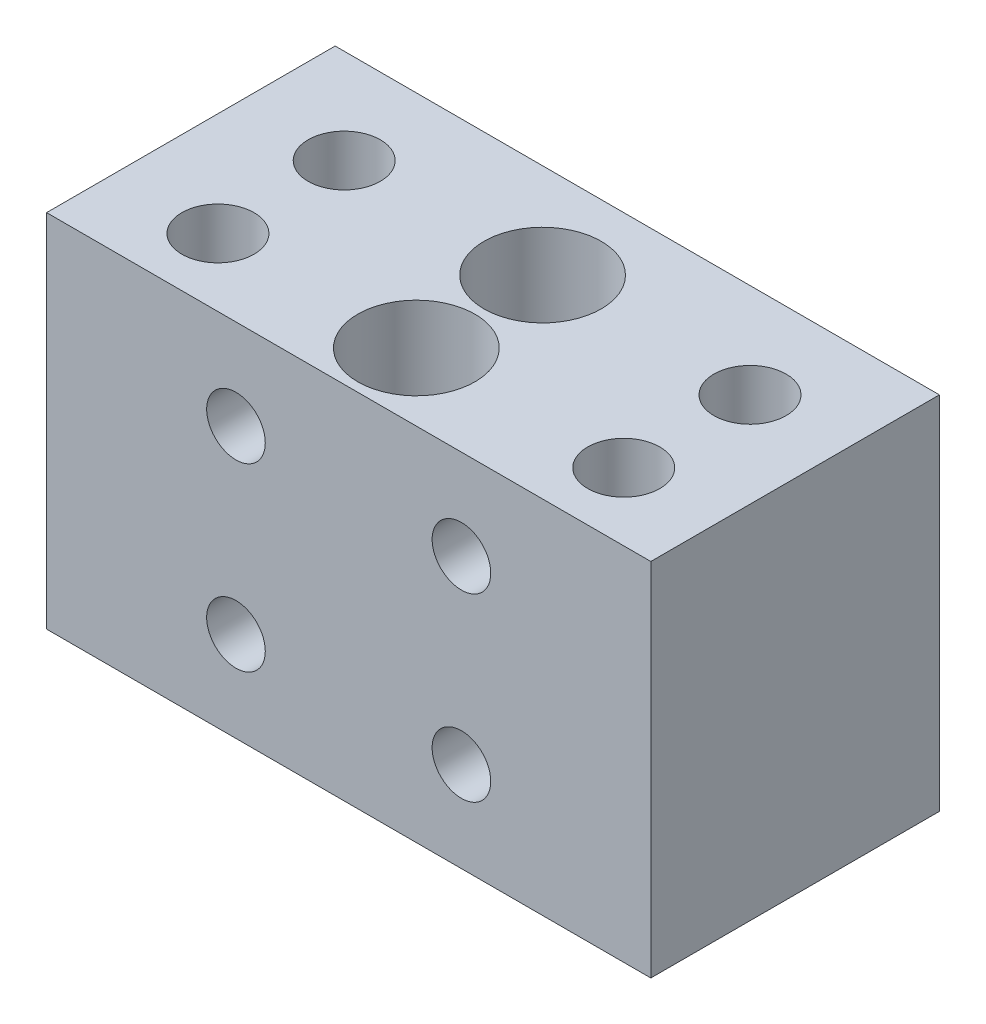
ISO-10303-21;
HEADER;
FILE_DESCRIPTION(('STEP AP214'),'2;1');
FILE_NAME('part.step','',(''),(''),'','','');
FILE_SCHEMA(('AUTOMOTIVE_DESIGN { 1 0 10303 214 1 1 1 1 }'));
ENDSEC;
DATA;
#1=APPLICATION_CONTEXT('core data for automotive mechanical design processes');
#2=APPLICATION_PROTOCOL_DEFINITION('international standard','automotive_design',2000,#1);
#3=PRODUCT_CONTEXT('',#1,'mechanical');
#4=PRODUCT('Part','Part','',(#3));
#5=PRODUCT_RELATED_PRODUCT_CATEGORY('part','',(#4));
#6=PRODUCT_DEFINITION_FORMATION('','',#4);
#7=PRODUCT_DEFINITION_CONTEXT('part definition',#1,'design');
#8=PRODUCT_DEFINITION('design','',#6,#7);
#9=PRODUCT_DEFINITION_SHAPE('','',#8);
#10=(LENGTH_UNIT() NAMED_UNIT(*) SI_UNIT(.MILLI.,.METRE.));
#11=(NAMED_UNIT(*) PLANE_ANGLE_UNIT() SI_UNIT($,.RADIAN.));
#12=(NAMED_UNIT(*) SI_UNIT($,.STERADIAN.) SOLID_ANGLE_UNIT());
#13=UNCERTAINTY_MEASURE_WITH_UNIT(LENGTH_MEASURE(1.E-05),#10,'distance_accuracy_value','');
#14=(GEOMETRIC_REPRESENTATION_CONTEXT(3) GLOBAL_UNCERTAINTY_ASSIGNED_CONTEXT((#13)) GLOBAL_UNIT_ASSIGNED_CONTEXT((#10,
#11,#12)) REPRESENTATION_CONTEXT('',''));
#15=CARTESIAN_POINT('',(0.,0.,0.));
#16=DIRECTION('',(0.,0.,1.));
#17=DIRECTION('',(1.,0.,0.));
#18=AXIS2_PLACEMENT_3D('',#15,#16,#17);
#19=CARTESIAN_POINT('',(56.5,40.,10.5));
#20=DIRECTION('',(0.,-1.,0.));
#21=DIRECTION('',(0.,0.,-1.));
#22=AXIS2_PLACEMENT_3D('',#19,#20,#21);
#23=CYLINDRICAL_SURFACE('',#22,4.);
#24=CARTESIAN_POINT('',(56.5,40.,10.5));
#25=DIRECTION('',(0.,-1.,0.));
#26=DIRECTION('',(0.,0.,-1.));
#27=AXIS2_PLACEMENT_3D('',#24,#25,#26);
#28=CIRCLE('',#27,4.);
#29=CARTESIAN_POINT('',(56.5,40.,6.5));
#30=VERTEX_POINT('',#29);
#31=EDGE_CURVE('E244',#30,#30,#28,.T.);
#32=ORIENTED_EDGE('',*,*,#31,.F.);
#33=EDGE_LOOP('',(#32));
#34=FACE_BOUND('',#33,.T.);
#35=CARTESIAN_POINT('',(56.5,19.,10.5));
#36=DIRECTION('',(0.,-1.,0.));
#37=DIRECTION('',(0.,0.,-1.));
#38=AXIS2_PLACEMENT_3D('',#35,#36,#37);
#39=CIRCLE('',#38,4.);
#40=CARTESIAN_POINT('',(56.5,19.,6.5));
#41=VERTEX_POINT('',#40);
#42=EDGE_CURVE('E11',#41,#41,#39,.T.);
#43=ORIENTED_EDGE('',*,*,#42,.T.);
#44=EDGE_LOOP('',(#43));
#45=FACE_BOUND('',#44,.T.);
#46=ADVANCED_FACE('F39',(#34,#45),#23,.F.);
#47=CARTESIAN_POINT('',(56.5,19.,10.5));
#48=DIRECTION('',(0.,-1.,0.));
#49=DIRECTION('',(0.,0.,-1.));
#50=AXIS2_PLACEMENT_3D('',#47,#48,#49);
#51=PLANE('',#50);
#52=ORIENTED_EDGE('',*,*,#42,.F.);
#53=EDGE_LOOP('',(#52));
#54=FACE_BOUND('',#53,.T.);
#55=CARTESIAN_POINT('',(56.5,19.,10.5));
#56=DIRECTION('',(0.,-1.,0.));
#57=DIRECTION('',(0.,0.,-1.));
#58=AXIS2_PLACEMENT_3D('',#55,#56,#57);
#59=CIRCLE('',#58,6.);
#60=CARTESIAN_POINT('',(56.5,19.,4.5));
#61=VERTEX_POINT('',#60);
#62=EDGE_CURVE('E47',#61,#61,#59,.T.);
#63=ORIENTED_EDGE('',*,*,#62,.T.);
#64=EDGE_LOOP('',(#63));
#65=FACE_BOUND('',#64,.T.);
#66=ADVANCED_FACE('F252',(#54,#65),#51,.T.);
#67=CARTESIAN_POINT('',(56.5,19.,10.5));
#68=DIRECTION('',(0.,-1.,0.));
#69=DIRECTION('',(0.,0.,-1.));
#70=AXIS2_PLACEMENT_3D('',#67,#68,#69);
#71=CYLINDRICAL_SURFACE('',#70,6.);
#72=ORIENTED_EDGE('',*,*,#62,.F.);
#73=EDGE_LOOP('',(#72));
#74=FACE_BOUND('',#73,.T.);
#75=CARTESIAN_POINT('',(56.5,0.,10.5));
#76=DIRECTION('',(0.,-1.,0.));
#77=DIRECTION('',(0.,0.,-1.));
#78=AXIS2_PLACEMENT_3D('',#75,#76,#77);
#79=CIRCLE('',#78,6.);
#80=CARTESIAN_POINT('',(56.5,0.,4.5));
#81=VERTEX_POINT('',#80);
#82=EDGE_CURVE('E247',#81,#81,#79,.T.);
#83=ORIENTED_EDGE('',*,*,#82,.T.);
#84=EDGE_LOOP('',(#83));
#85=FACE_BOUND('',#84,.T.);
#86=ADVANCED_FACE('F254',(#74,#85),#71,.F.);
#87=CARTESIAN_POINT('',(11.5,40.,10.5));
#88=DIRECTION('',(0.,-1.,0.));
#89=DIRECTION('',(0.,0.,-1.));
#90=AXIS2_PLACEMENT_3D('',#87,#88,#89);
#91=CYLINDRICAL_SURFACE('',#90,4.);
#92=CARTESIAN_POINT('',(11.5,40.,10.5));
#93=DIRECTION('',(0.,-1.,0.));
#94=DIRECTION('',(0.,0.,-1.));
#95=AXIS2_PLACEMENT_3D('',#92,#93,#94);
#96=CIRCLE('',#95,4.);
#97=CARTESIAN_POINT('',(11.5,40.,6.5));
#98=VERTEX_POINT('',#97);
#99=EDGE_CURVE('E232',#98,#98,#96,.T.);
#100=ORIENTED_EDGE('',*,*,#99,.F.);
#101=EDGE_LOOP('',(#100));
#102=FACE_BOUND('',#101,.T.);
#103=CARTESIAN_POINT('',(11.5,19.,10.5));
#104=DIRECTION('',(0.,-1.,0.));
#105=DIRECTION('',(0.,0.,-1.));
#106=AXIS2_PLACEMENT_3D('',#103,#104,#105);
#107=CIRCLE('',#106,4.);
#108=CARTESIAN_POINT('',(11.5,19.,6.5));
#109=VERTEX_POINT('',#108);
#110=EDGE_CURVE('E241',#109,#109,#107,.T.);
#111=ORIENTED_EDGE('',*,*,#110,.T.);
#112=EDGE_LOOP('',(#111));
#113=FACE_BOUND('',#112,.T.);
#114=ADVANCED_FACE('F257',(#102,#113),#91,.F.);
#115=CARTESIAN_POINT('',(11.5,19.,10.5));
#116=DIRECTION('',(0.,-1.,0.));
#117=DIRECTION('',(0.,0.,-1.));
#118=AXIS2_PLACEMENT_3D('',#115,#116,#117);
#119=PLANE('',#118);
#120=ORIENTED_EDGE('',*,*,#110,.F.);
#121=EDGE_LOOP('',(#120));
#122=FACE_BOUND('',#121,.T.);
#123=CARTESIAN_POINT('',(11.5,19.,10.5));
#124=DIRECTION('',(0.,-1.,0.));
#125=DIRECTION('',(0.,0.,-1.));
#126=AXIS2_PLACEMENT_3D('',#123,#124,#125);
#127=CIRCLE('',#126,6.);
#128=CARTESIAN_POINT('',(11.5,19.,4.5));
#129=VERTEX_POINT('',#128);
#130=EDGE_CURVE('E238',#129,#129,#127,.T.);
#131=ORIENTED_EDGE('',*,*,#130,.T.);
#132=EDGE_LOOP('',(#131));
#133=FACE_BOUND('',#132,.T.);
#134=ADVANCED_FACE('F572',(#122,#133),#119,.T.);
#135=CARTESIAN_POINT('',(11.5,19.,10.5));
#136=DIRECTION('',(0.,-1.,0.));
#137=DIRECTION('',(0.,0.,-1.));
#138=AXIS2_PLACEMENT_3D('',#135,#136,#137);
#139=CYLINDRICAL_SURFACE('',#138,6.);
#140=ORIENTED_EDGE('',*,*,#130,.F.);
#141=EDGE_LOOP('',(#140));
#142=FACE_BOUND('',#141,.T.);
#143=CARTESIAN_POINT('',(11.5,0.,10.5));
#144=DIRECTION('',(0.,-1.,0.));
#145=DIRECTION('',(0.,0.,-1.));
#146=AXIS2_PLACEMENT_3D('',#143,#144,#145);
#147=CIRCLE('',#146,6.);
#148=CARTESIAN_POINT('',(11.5,0.,4.5));
#149=VERTEX_POINT('',#148);
#150=EDGE_CURVE('E235',#149,#149,#147,.T.);
#151=ORIENTED_EDGE('',*,*,#150,.T.);
#152=EDGE_LOOP('',(#151));
#153=FACE_BOUND('',#152,.T.);
#154=ADVANCED_FACE('F273',(#142,#153),#139,.F.);
#155=CARTESIAN_POINT('',(0.,0.,32.));
#156=DIRECTION('',(1.,0.,0.));
#157=DIRECTION('',(0.,0.,-1.));
#158=AXIS2_PLACEMENT_3D('',#155,#156,#157);
#159=PLANE('',#158);
#160=DIRECTION('',(0.,-1.,0.));
#161=VECTOR('',#160,1.);
#162=CARTESIAN_POINT('',(0.,0.,0.));
#163=LINE('',#162,#161);
#164=CARTESIAN_POINT('',(0.,40.,0.));
#165=VERTEX_POINT('',#164);
#166=CARTESIAN_POINT('',(0.,0.,0.));
#167=VERTEX_POINT('',#166);
#168=EDGE_CURVE('E209',#165,#167,#163,.T.);
#169=ORIENTED_EDGE('',*,*,#168,.T.);
#170=DIRECTION('',(0.,0.,-1.));
#171=VECTOR('',#170,1.);
#172=CARTESIAN_POINT('',(0.,0.,32.));
#173=LINE('',#172,#171);
#174=CARTESIAN_POINT('',(0.,0.,32.));
#175=VERTEX_POINT('',#174);
#176=EDGE_CURVE('E230',#175,#167,#173,.T.);
#177=ORIENTED_EDGE('',*,*,#176,.F.);
#178=DIRECTION('',(0.,-1.,0.));
#179=VECTOR('',#178,1.);
#180=CARTESIAN_POINT('',(0.,0.,32.));
#181=LINE('',#180,#179);
#182=CARTESIAN_POINT('',(0.,40.,32.));
#183=VERTEX_POINT('',#182);
#184=EDGE_CURVE('E212',#183,#175,#181,.T.);
#185=ORIENTED_EDGE('',*,*,#184,.F.);
#186=DIRECTION('',(0.,0.,-1.));
#187=VECTOR('',#186,1.);
#188=CARTESIAN_POINT('',(0.,40.,32.));
#189=LINE('',#188,#187);
#190=EDGE_CURVE('E218',#183,#165,#189,.T.);
#191=ORIENTED_EDGE('',*,*,#190,.T.);
#192=EDGE_LOOP('',(#169,#177,#185,#191));
#193=FACE_BOUND('',#192,.T.);
#194=ADVANCED_FACE('F264',(#193),#159,.F.);
#195=CARTESIAN_POINT('',(0.,0.,32.));
#196=DIRECTION('',(0.,1.,0.));
#197=DIRECTION('',(0.,0.,1.));
#198=AXIS2_PLACEMENT_3D('',#195,#196,#197);
#199=PLANE('',#198);
#200=CARTESIAN_POINT('',(45.5,0.,17.5));
#201=DIRECTION('',(0.,-1.,0.));
#202=DIRECTION('',(0.,0.,-1.));
#203=AXIS2_PLACEMENT_3D('',#200,#201,#202);
#204=CIRCLE('',#203,1.24999999999999);
#205=CARTESIAN_POINT('',(45.5,0.,16.25));
#206=VERTEX_POINT('',#205);
#207=EDGE_CURVE('E105',#206,#206,#204,.T.);
#208=ORIENTED_EDGE('',*,*,#207,.F.);
#209=EDGE_LOOP('',(#208));
#210=FACE_BOUND('',#209,.T.);
#211=CARTESIAN_POINT('',(21.5,0.,17.5));
#212=DIRECTION('',(0.,-1.,0.));
#213=DIRECTION('',(0.,0.,-1.));
#214=AXIS2_PLACEMENT_3D('',#211,#212,#213);
#215=CIRCLE('',#214,1.24999999999999);
#216=CARTESIAN_POINT('',(21.5,0.,16.25));
#217=VERTEX_POINT('',#216);
#218=EDGE_CURVE('E104',#217,#217,#215,.T.);
#219=ORIENTED_EDGE('',*,*,#218,.F.);
#220=EDGE_LOOP('',(#219));
#221=FACE_BOUND('',#220,.T.);
#222=CARTESIAN_POINT('',(33.5,0.,24.5));
#223=DIRECTION('',(0.,1.,0.));
#224=DIRECTION('',(0.,0.,1.));
#225=AXIS2_PLACEMENT_3D('',#222,#223,#224);
#226=CIRCLE('',#225,1.65);
#227=CARTESIAN_POINT('',(33.5,0.,26.15));
#228=VERTEX_POINT('',#227);
#229=EDGE_CURVE('E166',#228,#228,#226,.T.);
#230=ORIENTED_EDGE('',*,*,#229,.T.);
#231=EDGE_LOOP('',(#230));
#232=FACE_BOUND('',#231,.T.);
#233=CARTESIAN_POINT('',(33.5,0.,10.5));
#234=DIRECTION('',(0.,1.,0.));
#235=DIRECTION('',(0.,0.,1.));
#236=AXIS2_PLACEMENT_3D('',#233,#234,#235);
#237=CIRCLE('',#236,1.65);
#238=CARTESIAN_POINT('',(33.5,0.,12.15));
#239=VERTEX_POINT('',#238);
#240=EDGE_CURVE('E172',#239,#239,#237,.T.);
#241=ORIENTED_EDGE('',*,*,#240,.T.);
#242=EDGE_LOOP('',(#241));
#243=FACE_BOUND('',#242,.T.);
#244=CARTESIAN_POINT('',(56.5,0.,24.5));
#245=DIRECTION('',(0.,-1.,0.));
#246=DIRECTION('',(0.,0.,-1.));
#247=AXIS2_PLACEMENT_3D('',#244,#245,#246);
#248=CIRCLE('',#247,6.);
#249=CARTESIAN_POINT('',(56.5,0.,18.5));
#250=VERTEX_POINT('',#249);
#251=EDGE_CURVE('E190',#250,#250,#248,.T.);
#252=ORIENTED_EDGE('',*,*,#251,.F.);
#253=EDGE_LOOP('',(#252));
#254=FACE_BOUND('',#253,.T.);
#255=CARTESIAN_POINT('',(11.5,0.,24.5));
#256=DIRECTION('',(0.,-1.,0.));
#257=DIRECTION('',(0.,0.,-1.));
#258=AXIS2_PLACEMENT_3D('',#255,#256,#257);
#259=CIRCLE('',#258,6.);
#260=CARTESIAN_POINT('',(11.5,0.,18.5));
#261=VERTEX_POINT('',#260);
#262=EDGE_CURVE('E203',#261,#261,#259,.T.);
#263=ORIENTED_EDGE('',*,*,#262,.F.);
#264=EDGE_LOOP('',(#263));
#265=FACE_BOUND('',#264,.T.);
#266=DIRECTION('',(1.,0.,0.));
#267=VECTOR('',#266,1.);
#268=CARTESIAN_POINT('',(0.,0.,0.));
#269=LINE('',#268,#267);
#270=CARTESIAN_POINT('',(67.,0.,0.));
#271=VERTEX_POINT('',#270);
#272=EDGE_CURVE('E221',#167,#271,#269,.T.);
#273=ORIENTED_EDGE('',*,*,#272,.T.);
#274=DIRECTION('',(0.,0.,-1.));
#275=VECTOR('',#274,1.);
#276=CARTESIAN_POINT('',(67.,0.,32.));
#277=LINE('',#276,#275);
#278=CARTESIAN_POINT('',(67.,0.,32.));
#279=VERTEX_POINT('',#278);
#280=EDGE_CURVE('E228',#279,#271,#277,.T.);
#281=ORIENTED_EDGE('',*,*,#280,.F.);
#282=DIRECTION('',(1.,0.,0.));
#283=VECTOR('',#282,1.);
#284=CARTESIAN_POINT('',(0.,0.,32.));
#285=LINE('',#284,#283);
#286=EDGE_CURVE('E87',#175,#279,#285,.T.);
#287=ORIENTED_EDGE('',*,*,#286,.F.);
#288=ORIENTED_EDGE('',*,*,#176,.T.);
#289=EDGE_LOOP('',(#273,#281,#287,#288));
#290=FACE_BOUND('',#289,.T.);
#291=ORIENTED_EDGE('',*,*,#150,.F.);
#292=EDGE_LOOP('',(#291));
#293=FACE_BOUND('',#292,.T.);
#294=ORIENTED_EDGE('',*,*,#82,.F.);
#295=EDGE_LOOP('',(#294));
#296=FACE_BOUND('',#295,.T.);
#297=ADVANCED_FACE('F261',(#210,#221,#232,#243,#254,#265,#290,#293,#296),#199,.F.);
#298=CARTESIAN_POINT('',(67.,0.,32.));
#299=DIRECTION('',(-1.,0.,0.));
#300=DIRECTION('',(0.,0.,1.));
#301=AXIS2_PLACEMENT_3D('',#298,#299,#300);
#302=PLANE('',#301);
#303=DIRECTION('',(0.,1.,0.));
#304=VECTOR('',#303,1.);
#305=CARTESIAN_POINT('',(67.,0.,0.));
#306=LINE('',#305,#304);
#307=CARTESIAN_POINT('',(67.,40.,0.));
#308=VERTEX_POINT('',#307);
#309=EDGE_CURVE('E73',#271,#308,#306,.T.);
#310=ORIENTED_EDGE('',*,*,#309,.T.);
#311=DIRECTION('',(0.,0.,-1.));
#312=VECTOR('',#311,1.);
#313=CARTESIAN_POINT('',(67.,40.,32.));
#314=LINE('',#313,#312);
#315=CARTESIAN_POINT('',(67.,40.,32.));
#316=VERTEX_POINT('',#315);
#317=EDGE_CURVE('E226',#316,#308,#314,.T.);
#318=ORIENTED_EDGE('',*,*,#317,.F.);
#319=DIRECTION('',(0.,1.,0.));
#320=VECTOR('',#319,1.);
#321=CARTESIAN_POINT('',(67.,0.,32.));
#322=LINE('',#321,#320);
#323=EDGE_CURVE('E215',#279,#316,#322,.T.);
#324=ORIENTED_EDGE('',*,*,#323,.F.);
#325=ORIENTED_EDGE('',*,*,#280,.T.);
#326=EDGE_LOOP('',(#310,#318,#324,#325));
#327=FACE_BOUND('',#326,.T.);
#328=ADVANCED_FACE('F263',(#327),#302,.F.);
#329=CARTESIAN_POINT('',(0.,40.,32.));
#330=DIRECTION('',(0.,-1.,0.));
#331=DIRECTION('',(0.,0.,-1.));
#332=AXIS2_PLACEMENT_3D('',#329,#330,#331);
#333=PLANE('',#332);
#334=CARTESIAN_POINT('',(33.5,40.,10.5));
#335=DIRECTION('',(0.,1.,0.));
#336=DIRECTION('',(0.,0.,1.));
#337=AXIS2_PLACEMENT_3D('',#334,#335,#336);
#338=CIRCLE('',#337,6.50000000000003);
#339=CARTESIAN_POINT('',(33.5,40.,17.));
#340=VERTEX_POINT('',#339);
#341=EDGE_CURVE('E180',#340,#340,#338,.T.);
#342=ORIENTED_EDGE('',*,*,#341,.F.);
#343=EDGE_LOOP('',(#342));
#344=FACE_BOUND('',#343,.T.);
#345=CARTESIAN_POINT('',(33.5,40.,24.5));
#346=DIRECTION('',(0.,1.,0.));
#347=DIRECTION('',(0.,0.,1.));
#348=AXIS2_PLACEMENT_3D('',#345,#346,#347);
#349=CIRCLE('',#348,6.50000000000003);
#350=CARTESIAN_POINT('',(33.5,40.,31.));
#351=VERTEX_POINT('',#350);
#352=EDGE_CURVE('E175',#351,#351,#349,.T.);
#353=ORIENTED_EDGE('',*,*,#352,.F.);
#354=EDGE_LOOP('',(#353));
#355=FACE_BOUND('',#354,.T.);
#356=CARTESIAN_POINT('',(56.5,40.,24.5));
#357=DIRECTION('',(0.,-1.,0.));
#358=DIRECTION('',(0.,0.,-1.));
#359=AXIS2_PLACEMENT_3D('',#356,#357,#358);
#360=CIRCLE('',#359,4.);
#361=CARTESIAN_POINT('',(56.5,40.,20.5));
#362=VERTEX_POINT('',#361);
#363=EDGE_CURVE('E179',#362,#362,#360,.T.);
#364=ORIENTED_EDGE('',*,*,#363,.T.);
#365=EDGE_LOOP('',(#364));
#366=FACE_BOUND('',#365,.T.);
#367=CARTESIAN_POINT('',(11.5,40.,24.5));
#368=DIRECTION('',(0.,-1.,0.));
#369=DIRECTION('',(0.,0.,-1.));
#370=AXIS2_PLACEMENT_3D('',#367,#368,#369);
#371=CIRCLE('',#370,4.);
#372=CARTESIAN_POINT('',(11.5,40.,20.5));
#373=VERTEX_POINT('',#372);
#374=EDGE_CURVE('E200',#373,#373,#371,.T.);
#375=ORIENTED_EDGE('',*,*,#374,.T.);
#376=EDGE_LOOP('',(#375));
#377=FACE_BOUND('',#376,.T.);
#378=DIRECTION('',(-1.,0.,0.));
#379=VECTOR('',#378,1.);
#380=CARTESIAN_POINT('',(0.,40.,0.));
#381=LINE('',#380,#379);
#382=EDGE_CURVE('E79',#308,#165,#381,.T.);
#383=ORIENTED_EDGE('',*,*,#382,.T.);
#384=ORIENTED_EDGE('',*,*,#190,.F.);
#385=DIRECTION('',(-1.,0.,0.));
#386=VECTOR('',#385,1.);
#387=CARTESIAN_POINT('',(0.,40.,32.));
#388=LINE('',#387,#386);
#389=EDGE_CURVE('E55',#316,#183,#388,.T.);
#390=ORIENTED_EDGE('',*,*,#389,.F.);
#391=ORIENTED_EDGE('',*,*,#317,.T.);
#392=EDGE_LOOP('',(#383,#384,#390,#391));
#393=FACE_BOUND('',#392,.T.);
#394=ORIENTED_EDGE('',*,*,#99,.T.);
#395=EDGE_LOOP('',(#394));
#396=FACE_BOUND('',#395,.T.);
#397=ORIENTED_EDGE('',*,*,#31,.T.);
#398=EDGE_LOOP('',(#397));
#399=FACE_BOUND('',#398,.T.);
#400=ADVANCED_FACE('F271',(#344,#355,#366,#377,#393,#396,#399),#333,.F.);
#401=CARTESIAN_POINT('',(0.,0.,32.));
#402=DIRECTION('',(0.,0.,-1.));
#403=DIRECTION('',(-1.,0.,0.));
#404=AXIS2_PLACEMENT_3D('',#401,#402,#403);
#405=PLANE('',#404);
#406=CARTESIAN_POINT('',(46.,10.,32.));
#407=DIRECTION('',(0.,0.,1.));
#408=DIRECTION('',(1.,0.,0.));
#409=AXIS2_PLACEMENT_3D('',#406,#407,#408);
#410=CIRCLE('',#409,3.25);
#411=CARTESIAN_POINT('',(49.25,10.,32.));
#412=VERTEX_POINT('',#411);
#413=EDGE_CURVE('E115',#412,#412,#410,.T.);
#414=ORIENTED_EDGE('',*,*,#413,.F.);
#415=EDGE_LOOP('',(#414));
#416=FACE_BOUND('',#415,.T.);
#417=CARTESIAN_POINT('',(46.,30.,32.));
#418=DIRECTION('',(0.,0.,1.));
#419=DIRECTION('',(1.,0.,0.));
#420=AXIS2_PLACEMENT_3D('',#417,#418,#419);
#421=CIRCLE('',#420,3.25);
#422=CARTESIAN_POINT('',(49.25,30.,32.));
#423=VERTEX_POINT('',#422);
#424=EDGE_CURVE('E127',#423,#423,#421,.T.);
#425=ORIENTED_EDGE('',*,*,#424,.F.);
#426=EDGE_LOOP('',(#425));
#427=FACE_BOUND('',#426,.T.);
#428=CARTESIAN_POINT('',(21.,10.,32.));
#429=DIRECTION('',(0.,0.,1.));
#430=DIRECTION('',(1.,0.,0.));
#431=AXIS2_PLACEMENT_3D('',#428,#429,#430);
#432=CIRCLE('',#431,3.25);
#433=CARTESIAN_POINT('',(24.25,10.,32.));
#434=VERTEX_POINT('',#433);
#435=EDGE_CURVE('E139',#434,#434,#432,.T.);
#436=ORIENTED_EDGE('',*,*,#435,.F.);
#437=EDGE_LOOP('',(#436));
#438=FACE_BOUND('',#437,.T.);
#439=CARTESIAN_POINT('',(21.,30.,32.));
#440=DIRECTION('',(0.,0.,1.));
#441=DIRECTION('',(1.,0.,0.));
#442=AXIS2_PLACEMENT_3D('',#439,#440,#441);
#443=CIRCLE('',#442,3.25);
#444=CARTESIAN_POINT('',(24.25,30.,32.));
#445=VERTEX_POINT('',#444);
#446=EDGE_CURVE('E151',#445,#445,#443,.T.);
#447=ORIENTED_EDGE('',*,*,#446,.F.);
#448=EDGE_LOOP('',(#447));
#449=FACE_BOUND('',#448,.T.);
#450=ORIENTED_EDGE('',*,*,#184,.T.);
#451=ORIENTED_EDGE('',*,*,#286,.T.);
#452=ORIENTED_EDGE('',*,*,#323,.T.);
#453=ORIENTED_EDGE('',*,*,#389,.T.);
#454=EDGE_LOOP('',(#450,#451,#452,#453));
#455=FACE_BOUND('',#454,.T.);
#456=ADVANCED_FACE('F289',(#416,#427,#438,#449,#455),#405,.F.);
#457=CARTESIAN_POINT('',(0.,0.,0.));
#458=DIRECTION('',(0.,0.,-1.));
#459=DIRECTION('',(-1.,0.,0.));
#460=AXIS2_PLACEMENT_3D('',#457,#458,#459);
#461=PLANE('',#460);
#462=CARTESIAN_POINT('',(46.,10.,0.));
#463=DIRECTION('',(0.,0.,1.));
#464=DIRECTION('',(1.,0.,0.));
#465=AXIS2_PLACEMENT_3D('',#462,#463,#464);
#466=CIRCLE('',#465,1.69999999999999);
#467=CARTESIAN_POINT('',(47.7,10.,0.));
#468=VERTEX_POINT('',#467);
#469=EDGE_CURVE('E124',#468,#468,#466,.T.);
#470=ORIENTED_EDGE('',*,*,#469,.T.);
#471=EDGE_LOOP('',(#470));
#472=FACE_BOUND('',#471,.T.);
#473=CARTESIAN_POINT('',(46.,30.,0.));
#474=DIRECTION('',(0.,0.,1.));
#475=DIRECTION('',(1.,0.,0.));
#476=AXIS2_PLACEMENT_3D('',#473,#474,#475);
#477=CIRCLE('',#476,1.69999999999999);
#478=CARTESIAN_POINT('',(47.7,30.,0.));
#479=VERTEX_POINT('',#478);
#480=EDGE_CURVE('E136',#479,#479,#477,.T.);
#481=ORIENTED_EDGE('',*,*,#480,.T.);
#482=EDGE_LOOP('',(#481));
#483=FACE_BOUND('',#482,.T.);
#484=CARTESIAN_POINT('',(21.,10.,0.));
#485=DIRECTION('',(0.,0.,1.));
#486=DIRECTION('',(1.,0.,0.));
#487=AXIS2_PLACEMENT_3D('',#484,#485,#486);
#488=CIRCLE('',#487,1.69999999999999);
#489=CARTESIAN_POINT('',(22.7,10.,0.));
#490=VERTEX_POINT('',#489);
#491=EDGE_CURVE('E148',#490,#490,#488,.T.);
#492=ORIENTED_EDGE('',*,*,#491,.T.);
#493=EDGE_LOOP('',(#492));
#494=FACE_BOUND('',#493,.T.);
#495=CARTESIAN_POINT('',(21.,30.,0.));
#496=DIRECTION('',(0.,0.,1.));
#497=DIRECTION('',(1.,0.,0.));
#498=AXIS2_PLACEMENT_3D('',#495,#496,#497);
#499=CIRCLE('',#498,1.69999999999999);
#500=CARTESIAN_POINT('',(22.7,30.,0.));
#501=VERTEX_POINT('',#500);
#502=EDGE_CURVE('E160',#501,#501,#499,.T.);
#503=ORIENTED_EDGE('',*,*,#502,.T.);
#504=EDGE_LOOP('',(#503));
#505=FACE_BOUND('',#504,.T.);
#506=ORIENTED_EDGE('',*,*,#168,.F.);
#507=ORIENTED_EDGE('',*,*,#382,.F.);
#508=ORIENTED_EDGE('',*,*,#309,.F.);
#509=ORIENTED_EDGE('',*,*,#272,.F.);
#510=EDGE_LOOP('',(#506,#507,#508,#509));
#511=FACE_BOUND('',#510,.T.);
#512=ADVANCED_FACE('F295',(#472,#483,#494,#505,#511),#461,.T.);
#513=CARTESIAN_POINT('',(11.5,19.,24.5));
#514=DIRECTION('',(0.,-1.,0.));
#515=DIRECTION('',(0.,0.,-1.));
#516=AXIS2_PLACEMENT_3D('',#513,#514,#515);
#517=CYLINDRICAL_SURFACE('',#516,6.);
#518=CARTESIAN_POINT('',(11.5,19.,24.5));
#519=DIRECTION('',(0.,-1.,0.));
#520=DIRECTION('',(0.,0.,-1.));
#521=AXIS2_PLACEMENT_3D('',#518,#519,#520);
#522=CIRCLE('',#521,6.);
#523=CARTESIAN_POINT('',(11.5,19.,18.5));
#524=VERTEX_POINT('',#523);
#525=EDGE_CURVE('E206',#524,#524,#522,.T.);
#526=ORIENTED_EDGE('',*,*,#525,.F.);
#527=EDGE_LOOP('',(#526));
#528=FACE_BOUND('',#527,.T.);
#529=ORIENTED_EDGE('',*,*,#262,.T.);
#530=EDGE_LOOP('',(#529));
#531=FACE_BOUND('',#530,.T.);
#532=ADVANCED_FACE('F302',(#528,#531),#517,.F.);
#533=CARTESIAN_POINT('',(11.5,19.,24.5));
#534=DIRECTION('',(0.,-1.,0.));
#535=DIRECTION('',(0.,0.,-1.));
#536=AXIS2_PLACEMENT_3D('',#533,#534,#535);
#537=PLANE('',#536);
#538=CARTESIAN_POINT('',(11.5,19.,24.5));
#539=DIRECTION('',(0.,-1.,0.));
#540=DIRECTION('',(0.,0.,-1.));
#541=AXIS2_PLACEMENT_3D('',#538,#539,#540);
#542=CIRCLE('',#541,4.);
#543=CARTESIAN_POINT('',(11.5,19.,20.5));
#544=VERTEX_POINT('',#543);
#545=EDGE_CURVE('E199',#544,#544,#542,.T.);
#546=ORIENTED_EDGE('',*,*,#545,.F.);
#547=EDGE_LOOP('',(#546));
#548=FACE_BOUND('',#547,.T.);
#549=ORIENTED_EDGE('',*,*,#525,.T.);
#550=EDGE_LOOP('',(#549));
#551=FACE_BOUND('',#550,.T.);
#552=ADVANCED_FACE('F307',(#548,#551),#537,.T.);
#553=CARTESIAN_POINT('',(11.5,40.,24.5));
#554=DIRECTION('',(0.,-1.,0.));
#555=DIRECTION('',(0.,0.,-1.));
#556=AXIS2_PLACEMENT_3D('',#553,#554,#555);
#557=CYLINDRICAL_SURFACE('',#556,4.);
#558=ORIENTED_EDGE('',*,*,#374,.F.);
#559=EDGE_LOOP('',(#558));
#560=FACE_BOUND('',#559,.T.);
#561=ORIENTED_EDGE('',*,*,#545,.T.);
#562=EDGE_LOOP('',(#561));
#563=FACE_BOUND('',#562,.T.);
#564=ADVANCED_FACE('F311',(#560,#563),#557,.F.);
#565=CARTESIAN_POINT('',(56.5,19.,24.5));
#566=DIRECTION('',(0.,-1.,0.));
#567=DIRECTION('',(0.,0.,-1.));
#568=AXIS2_PLACEMENT_3D('',#565,#566,#567);
#569=CYLINDRICAL_SURFACE('',#568,6.);
#570=CARTESIAN_POINT('',(56.5,19.,24.5));
#571=DIRECTION('',(0.,-1.,0.));
#572=DIRECTION('',(0.,0.,-1.));
#573=AXIS2_PLACEMENT_3D('',#570,#571,#572);
#574=CIRCLE('',#573,6.);
#575=CARTESIAN_POINT('',(56.5,19.,18.5));
#576=VERTEX_POINT('',#575);
#577=EDGE_CURVE('E196',#576,#576,#574,.T.);
#578=ORIENTED_EDGE('',*,*,#577,.F.);
#579=EDGE_LOOP('',(#578));
#580=FACE_BOUND('',#579,.T.);
#581=ORIENTED_EDGE('',*,*,#251,.T.);
#582=EDGE_LOOP('',(#581));
#583=FACE_BOUND('',#582,.T.);
#584=ADVANCED_FACE('F315',(#580,#583),#569,.F.);
#585=CARTESIAN_POINT('',(56.5,19.,24.5));
#586=DIRECTION('',(0.,-1.,0.));
#587=DIRECTION('',(0.,0.,-1.));
#588=AXIS2_PLACEMENT_3D('',#585,#586,#587);
#589=PLANE('',#588);
#590=CARTESIAN_POINT('',(56.5,19.,24.5));
#591=DIRECTION('',(0.,-1.,0.));
#592=DIRECTION('',(0.,0.,-1.));
#593=AXIS2_PLACEMENT_3D('',#590,#591,#592);
#594=CIRCLE('',#593,4.);
#595=CARTESIAN_POINT('',(56.5,19.,20.5));
#596=VERTEX_POINT('',#595);
#597=EDGE_CURVE('E193',#596,#596,#594,.T.);
#598=ORIENTED_EDGE('',*,*,#597,.F.);
#599=EDGE_LOOP('',(#598));
#600=FACE_BOUND('',#599,.T.);
#601=ORIENTED_EDGE('',*,*,#577,.T.);
#602=EDGE_LOOP('',(#601));
#603=FACE_BOUND('',#602,.T.);
#604=ADVANCED_FACE('F319',(#600,#603),#589,.T.);
#605=CARTESIAN_POINT('',(56.5,40.,24.5));
#606=DIRECTION('',(0.,-1.,0.));
#607=DIRECTION('',(0.,0.,-1.));
#608=AXIS2_PLACEMENT_3D('',#605,#606,#607);
#609=CYLINDRICAL_SURFACE('',#608,4.);
#610=ORIENTED_EDGE('',*,*,#363,.F.);
#611=EDGE_LOOP('',(#610));
#612=FACE_BOUND('',#611,.T.);
#613=ORIENTED_EDGE('',*,*,#597,.T.);
#614=EDGE_LOOP('',(#613));
#615=FACE_BOUND('',#614,.T.);
#616=ADVANCED_FACE('F323',(#612,#615),#609,.F.);
#617=CARTESIAN_POINT('',(33.5,5.,24.5));
#618=DIRECTION('',(0.,1.,0.));
#619=DIRECTION('',(0.,0.,1.));
#620=AXIS2_PLACEMENT_3D('',#617,#618,#619);
#621=CYLINDRICAL_SURFACE('',#620,6.50000000000003);
#622=CARTESIAN_POINT('',(33.5,5.,24.5));
#623=DIRECTION('',(0.,1.,0.));
#624=DIRECTION('',(0.,0.,1.));
#625=AXIS2_PLACEMENT_3D('',#622,#623,#624);
#626=CIRCLE('',#625,6.50000000000003);
#627=CARTESIAN_POINT('',(33.5,5.,31.));
#628=VERTEX_POINT('',#627);
#629=EDGE_CURVE('E183',#628,#628,#626,.T.);
#630=ORIENTED_EDGE('',*,*,#629,.F.);
#631=EDGE_LOOP('',(#630));
#632=FACE_BOUND('',#631,.T.);
#633=ORIENTED_EDGE('',*,*,#352,.T.);
#634=EDGE_LOOP('',(#633));
#635=FACE_BOUND('',#634,.T.);
#636=ADVANCED_FACE('F327',(#632,#635),#621,.F.);
#637=CARTESIAN_POINT('',(33.5,5.,24.5));
#638=DIRECTION('',(0.,1.,0.));
#639=DIRECTION('',(0.,0.,1.));
#640=AXIS2_PLACEMENT_3D('',#637,#638,#639);
#641=PLANE('',#640);
#642=CARTESIAN_POINT('',(33.5,5.,24.5));
#643=DIRECTION('',(0.,1.,0.));
#644=DIRECTION('',(0.,0.,1.));
#645=AXIS2_PLACEMENT_3D('',#642,#643,#644);
#646=CIRCLE('',#645,1.64999999999998);
#647=CARTESIAN_POINT('',(33.5,5.,26.15));
#648=VERTEX_POINT('',#647);
#649=EDGE_CURVE('E163',#648,#648,#646,.T.);
#650=ORIENTED_EDGE('',*,*,#649,.F.);
#651=EDGE_LOOP('',(#650));
#652=FACE_BOUND('',#651,.T.);
#653=ORIENTED_EDGE('',*,*,#629,.T.);
#654=EDGE_LOOP('',(#653));
#655=FACE_BOUND('',#654,.T.);
#656=ADVANCED_FACE('F331',(#652,#655),#641,.T.);
#657=CARTESIAN_POINT('',(33.5,5.,10.5));
#658=DIRECTION('',(0.,1.,0.));
#659=DIRECTION('',(0.,0.,1.));
#660=AXIS2_PLACEMENT_3D('',#657,#658,#659);
#661=CYLINDRICAL_SURFACE('',#660,6.50000000000003);
#662=CARTESIAN_POINT('',(33.5,5.,10.5));
#663=DIRECTION('',(0.,1.,0.));
#664=DIRECTION('',(0.,0.,1.));
#665=AXIS2_PLACEMENT_3D('',#662,#663,#664);
#666=CIRCLE('',#665,6.50000000000003);
#667=CARTESIAN_POINT('',(33.5,5.,17.));
#668=VERTEX_POINT('',#667);
#669=EDGE_CURVE('E176',#668,#668,#666,.T.);
#670=ORIENTED_EDGE('',*,*,#669,.F.);
#671=EDGE_LOOP('',(#670));
#672=FACE_BOUND('',#671,.T.);
#673=ORIENTED_EDGE('',*,*,#341,.T.);
#674=EDGE_LOOP('',(#673));
#675=FACE_BOUND('',#674,.T.);
#676=ADVANCED_FACE('F335',(#672,#675),#661,.F.);
#677=CARTESIAN_POINT('',(33.5,5.,10.5));
#678=DIRECTION('',(0.,1.,0.));
#679=DIRECTION('',(0.,0.,1.));
#680=AXIS2_PLACEMENT_3D('',#677,#678,#679);
#681=PLANE('',#680);
#682=CARTESIAN_POINT('',(33.5,5.,10.5));
#683=DIRECTION('',(0.,1.,0.));
#684=DIRECTION('',(0.,0.,1.));
#685=AXIS2_PLACEMENT_3D('',#682,#683,#684);
#686=CIRCLE('',#685,1.64999999999998);
#687=CARTESIAN_POINT('',(33.5,5.,12.15));
#688=VERTEX_POINT('',#687);
#689=EDGE_CURVE('E169',#688,#688,#686,.T.);
#690=ORIENTED_EDGE('',*,*,#689,.F.);
#691=EDGE_LOOP('',(#690));
#692=FACE_BOUND('',#691,.T.);
#693=ORIENTED_EDGE('',*,*,#669,.T.);
#694=EDGE_LOOP('',(#693));
#695=FACE_BOUND('',#694,.T.);
#696=ADVANCED_FACE('F339',(#692,#695),#681,.T.);
#697=CARTESIAN_POINT('',(33.5,5.,10.5));
#698=DIRECTION('',(0.,1.,0.));
#699=DIRECTION('',(0.,0.,1.));
#700=AXIS2_PLACEMENT_3D('',#697,#698,#699);
#701=CYLINDRICAL_SURFACE('',#700,1.64999999999999);
#702=ORIENTED_EDGE('',*,*,#240,.F.);
#703=EDGE_LOOP('',(#702));
#704=FACE_BOUND('',#703,.T.);
#705=ORIENTED_EDGE('',*,*,#689,.T.);
#706=EDGE_LOOP('',(#705));
#707=FACE_BOUND('',#706,.T.);
#708=ADVANCED_FACE('F343',(#704,#707),#701,.F.);
#709=CARTESIAN_POINT('',(33.5,5.,24.5));
#710=DIRECTION('',(0.,1.,0.));
#711=DIRECTION('',(0.,0.,1.));
#712=AXIS2_PLACEMENT_3D('',#709,#710,#711);
#713=CYLINDRICAL_SURFACE('',#712,1.64999999999999);
#714=ORIENTED_EDGE('',*,*,#229,.F.);
#715=EDGE_LOOP('',(#714));
#716=FACE_BOUND('',#715,.T.);
#717=ORIENTED_EDGE('',*,*,#649,.T.);
#718=EDGE_LOOP('',(#717));
#719=FACE_BOUND('',#718,.T.);
#720=ADVANCED_FACE('F347',(#716,#719),#713,.F.);
#721=CARTESIAN_POINT('',(21.,30.,32.));
#722=DIRECTION('',(0.,0.,1.));
#723=DIRECTION('',(1.,0.,0.));
#724=AXIS2_PLACEMENT_3D('',#721,#722,#723);
#725=CYLINDRICAL_SURFACE('',#724,1.69999999999999);
#726=ORIENTED_EDGE('',*,*,#502,.F.);
#727=EDGE_LOOP('',(#726));
#728=FACE_BOUND('',#727,.T.);
#729=CARTESIAN_POINT('',(21.,30.,2.));
#730=DIRECTION('',(0.,0.,1.));
#731=DIRECTION('',(1.,0.,0.));
#732=AXIS2_PLACEMENT_3D('',#729,#730,#731);
#733=CIRCLE('',#732,1.69999999999999);
#734=CARTESIAN_POINT('',(22.7,30.,2.));
#735=VERTEX_POINT('',#734);
#736=EDGE_CURVE('E157',#735,#735,#733,.T.);
#737=ORIENTED_EDGE('',*,*,#736,.T.);
#738=EDGE_LOOP('',(#737));
#739=FACE_BOUND('',#738,.T.);
#740=ADVANCED_FACE('F351',(#728,#739),#725,.F.);
#741=CARTESIAN_POINT('',(22.7,30.,2.));
#742=DIRECTION('',(0.,0.,-1.));
#743=DIRECTION('',(-1.,0.,0.));
#744=AXIS2_PLACEMENT_3D('',#741,#742,#743);
#745=PLANE('',#744);
#746=ORIENTED_EDGE('',*,*,#736,.F.);
#747=EDGE_LOOP('',(#746));
#748=FACE_BOUND('',#747,.T.);
#749=CARTESIAN_POINT('',(21.,30.,2.));
#750=DIRECTION('',(0.,0.,1.));
#751=DIRECTION('',(1.,0.,0.));
#752=AXIS2_PLACEMENT_3D('',#749,#750,#751);
#753=CIRCLE('',#752,3.24999999999999);
#754=CARTESIAN_POINT('',(24.25,30.,2.));
#755=VERTEX_POINT('',#754);
#756=EDGE_CURVE('E154',#755,#755,#753,.T.);
#757=ORIENTED_EDGE('',*,*,#756,.T.);
#758=EDGE_LOOP('',(#757));
#759=FACE_BOUND('',#758,.T.);
#760=ADVANCED_FACE('F355',(#748,#759),#745,.F.);
#761=CARTESIAN_POINT('',(21.,30.,32.));
#762=DIRECTION('',(0.,0.,1.));
#763=DIRECTION('',(1.,0.,0.));
#764=AXIS2_PLACEMENT_3D('',#761,#762,#763);
#765=CYLINDRICAL_SURFACE('',#764,3.24999999999999);
#766=ORIENTED_EDGE('',*,*,#756,.F.);
#767=EDGE_LOOP('',(#766));
#768=FACE_BOUND('',#767,.T.);
#769=ORIENTED_EDGE('',*,*,#446,.T.);
#770=EDGE_LOOP('',(#769));
#771=FACE_BOUND('',#770,.T.);
#772=ADVANCED_FACE('F359',(#768,#771),#765,.F.);
#773=CARTESIAN_POINT('',(21.,10.,32.));
#774=DIRECTION('',(0.,0.,1.));
#775=DIRECTION('',(1.,0.,0.));
#776=AXIS2_PLACEMENT_3D('',#773,#774,#775);
#777=CYLINDRICAL_SURFACE('',#776,1.69999999999999);
#778=ORIENTED_EDGE('',*,*,#491,.F.);
#779=EDGE_LOOP('',(#778));
#780=FACE_BOUND('',#779,.T.);
#781=CARTESIAN_POINT('',(21.,10.,2.));
#782=DIRECTION('',(0.,0.,1.));
#783=DIRECTION('',(1.,0.,0.));
#784=AXIS2_PLACEMENT_3D('',#781,#782,#783);
#785=CIRCLE('',#784,1.69999999999999);
#786=CARTESIAN_POINT('',(22.7,10.,2.));
#787=VERTEX_POINT('',#786);
#788=EDGE_CURVE('E145',#787,#787,#785,.T.);
#789=ORIENTED_EDGE('',*,*,#788,.T.);
#790=EDGE_LOOP('',(#789));
#791=FACE_BOUND('',#790,.T.);
#792=ADVANCED_FACE('F363',(#780,#791),#777,.F.);
#793=CARTESIAN_POINT('',(22.7,10.,2.));
#794=DIRECTION('',(0.,0.,-1.));
#795=DIRECTION('',(-1.,0.,0.));
#796=AXIS2_PLACEMENT_3D('',#793,#794,#795);
#797=PLANE('',#796);
#798=ORIENTED_EDGE('',*,*,#788,.F.);
#799=EDGE_LOOP('',(#798));
#800=FACE_BOUND('',#799,.T.);
#801=CARTESIAN_POINT('',(21.,10.,2.));
#802=DIRECTION('',(0.,0.,1.));
#803=DIRECTION('',(1.,0.,0.));
#804=AXIS2_PLACEMENT_3D('',#801,#802,#803);
#805=CIRCLE('',#804,3.24999999999999);
#806=CARTESIAN_POINT('',(24.25,10.,2.));
#807=VERTEX_POINT('',#806);
#808=EDGE_CURVE('E142',#807,#807,#805,.T.);
#809=ORIENTED_EDGE('',*,*,#808,.T.);
#810=EDGE_LOOP('',(#809));
#811=FACE_BOUND('',#810,.T.);
#812=ADVANCED_FACE('F367',(#800,#811),#797,.F.);
#813=CARTESIAN_POINT('',(21.,10.,32.));
#814=DIRECTION('',(0.,0.,1.));
#815=DIRECTION('',(1.,0.,0.));
#816=AXIS2_PLACEMENT_3D('',#813,#814,#815);
#817=CYLINDRICAL_SURFACE('',#816,3.24999999999999);
#818=ORIENTED_EDGE('',*,*,#808,.F.);
#819=EDGE_LOOP('',(#818));
#820=FACE_BOUND('',#819,.T.);
#821=ORIENTED_EDGE('',*,*,#435,.T.);
#822=EDGE_LOOP('',(#821));
#823=FACE_BOUND('',#822,.T.);
#824=ADVANCED_FACE('F371',(#820,#823),#817,.F.);
#825=CARTESIAN_POINT('',(46.,30.,32.));
#826=DIRECTION('',(0.,0.,1.));
#827=DIRECTION('',(1.,0.,0.));
#828=AXIS2_PLACEMENT_3D('',#825,#826,#827);
#829=CYLINDRICAL_SURFACE('',#828,1.69999999999999);
#830=ORIENTED_EDGE('',*,*,#480,.F.);
#831=EDGE_LOOP('',(#830));
#832=FACE_BOUND('',#831,.T.);
#833=CARTESIAN_POINT('',(46.,30.,2.));
#834=DIRECTION('',(0.,0.,1.));
#835=DIRECTION('',(1.,0.,0.));
#836=AXIS2_PLACEMENT_3D('',#833,#834,#835);
#837=CIRCLE('',#836,1.69999999999999);
#838=CARTESIAN_POINT('',(47.7,30.,2.));
#839=VERTEX_POINT('',#838);
#840=EDGE_CURVE('E133',#839,#839,#837,.T.);
#841=ORIENTED_EDGE('',*,*,#840,.T.);
#842=EDGE_LOOP('',(#841));
#843=FACE_BOUND('',#842,.T.);
#844=ADVANCED_FACE('F375',(#832,#843),#829,.F.);
#845=CARTESIAN_POINT('',(47.7,30.,2.));
#846=DIRECTION('',(0.,0.,-1.));
#847=DIRECTION('',(-1.,0.,0.));
#848=AXIS2_PLACEMENT_3D('',#845,#846,#847);
#849=PLANE('',#848);
#850=ORIENTED_EDGE('',*,*,#840,.F.);
#851=EDGE_LOOP('',(#850));
#852=FACE_BOUND('',#851,.T.);
#853=CARTESIAN_POINT('',(46.,30.,2.));
#854=DIRECTION('',(0.,0.,1.));
#855=DIRECTION('',(1.,0.,0.));
#856=AXIS2_PLACEMENT_3D('',#853,#854,#855);
#857=CIRCLE('',#856,3.25);
#858=CARTESIAN_POINT('',(49.25,30.,2.));
#859=VERTEX_POINT('',#858);
#860=EDGE_CURVE('E130',#859,#859,#857,.T.);
#861=ORIENTED_EDGE('',*,*,#860,.T.);
#862=EDGE_LOOP('',(#861));
#863=FACE_BOUND('',#862,.T.);
#864=ADVANCED_FACE('F379',(#852,#863),#849,.F.);
#865=CARTESIAN_POINT('',(46.,30.,32.));
#866=DIRECTION('',(0.,0.,1.));
#867=DIRECTION('',(1.,0.,0.));
#868=AXIS2_PLACEMENT_3D('',#865,#866,#867);
#869=CYLINDRICAL_SURFACE('',#868,3.25);
#870=ORIENTED_EDGE('',*,*,#860,.F.);
#871=EDGE_LOOP('',(#870));
#872=FACE_BOUND('',#871,.T.);
#873=ORIENTED_EDGE('',*,*,#424,.T.);
#874=EDGE_LOOP('',(#873));
#875=FACE_BOUND('',#874,.T.);
#876=ADVANCED_FACE('F383',(#872,#875),#869,.F.);
#877=CARTESIAN_POINT('',(46.,10.,32.));
#878=DIRECTION('',(0.,0.,1.));
#879=DIRECTION('',(1.,0.,0.));
#880=AXIS2_PLACEMENT_3D('',#877,#878,#879);
#881=CYLINDRICAL_SURFACE('',#880,1.69999999999999);
#882=ORIENTED_EDGE('',*,*,#469,.F.);
#883=EDGE_LOOP('',(#882));
#884=FACE_BOUND('',#883,.T.);
#885=CARTESIAN_POINT('',(46.,10.,2.));
#886=DIRECTION('',(0.,0.,1.));
#887=DIRECTION('',(1.,0.,0.));
#888=AXIS2_PLACEMENT_3D('',#885,#886,#887);
#889=CIRCLE('',#888,1.69999999999999);
#890=CARTESIAN_POINT('',(47.7,10.,2.));
#891=VERTEX_POINT('',#890);
#892=EDGE_CURVE('E121',#891,#891,#889,.T.);
#893=ORIENTED_EDGE('',*,*,#892,.T.);
#894=EDGE_LOOP('',(#893));
#895=FACE_BOUND('',#894,.T.);
#896=ADVANCED_FACE('F387',(#884,#895),#881,.F.);
#897=CARTESIAN_POINT('',(47.7,10.,2.));
#898=DIRECTION('',(0.,0.,-1.));
#899=DIRECTION('',(-1.,0.,0.));
#900=AXIS2_PLACEMENT_3D('',#897,#898,#899);
#901=PLANE('',#900);
#902=ORIENTED_EDGE('',*,*,#892,.F.);
#903=EDGE_LOOP('',(#902));
#904=FACE_BOUND('',#903,.T.);
#905=CARTESIAN_POINT('',(46.,10.,2.));
#906=DIRECTION('',(0.,0.,1.));
#907=DIRECTION('',(1.,0.,0.));
#908=AXIS2_PLACEMENT_3D('',#905,#906,#907);
#909=CIRCLE('',#908,3.25);
#910=CARTESIAN_POINT('',(49.25,10.,2.));
#911=VERTEX_POINT('',#910);
#912=EDGE_CURVE('E118',#911,#911,#909,.T.);
#913=ORIENTED_EDGE('',*,*,#912,.T.);
#914=EDGE_LOOP('',(#913));
#915=FACE_BOUND('',#914,.T.);
#916=ADVANCED_FACE('F391',(#904,#915),#901,.F.);
#917=CARTESIAN_POINT('',(46.,10.,32.));
#918=DIRECTION('',(0.,0.,1.));
#919=DIRECTION('',(1.,0.,0.));
#920=AXIS2_PLACEMENT_3D('',#917,#918,#919);
#921=CYLINDRICAL_SURFACE('',#920,3.25);
#922=ORIENTED_EDGE('',*,*,#912,.F.);
#923=EDGE_LOOP('',(#922));
#924=FACE_BOUND('',#923,.T.);
#925=ORIENTED_EDGE('',*,*,#413,.T.);
#926=EDGE_LOOP('',(#925));
#927=FACE_BOUND('',#926,.T.);
#928=ADVANCED_FACE('F395',(#924,#927),#921,.F.);
#929=CARTESIAN_POINT('',(21.5,5.5,17.5));
#930=DIRECTION('',(0.,-1.,0.));
#931=DIRECTION('',(0.,0.,-1.));
#932=AXIS2_PLACEMENT_3D('',#929,#930,#931);
#933=CONICAL_SURFACE('',#932,1.24999999999999,1.02974425867665);
#934=CARTESIAN_POINT('',(21.5,6.25107577378445,17.5));
#935=VERTEX_POINT('',#934);
#936=VERTEX_LOOP('',#935);
#937=FACE_BOUND('',#936,.T.);
#938=CARTESIAN_POINT('',(21.5,5.5,17.5));
#939=DIRECTION('',(0.,-1.,0.));
#940=DIRECTION('',(0.,0.,-1.));
#941=AXIS2_PLACEMENT_3D('',#938,#939,#940);
#942=CIRCLE('',#941,1.24999999999999);
#943=CARTESIAN_POINT('',(21.5,5.5,16.25));
#944=VERTEX_POINT('',#943);
#945=EDGE_CURVE('E108',#944,#944,#942,.T.);
#946=ORIENTED_EDGE('',*,*,#945,.T.);
#947=EDGE_LOOP('',(#946));
#948=FACE_BOUND('',#947,.T.);
#949=ADVANCED_FACE('F399',(#937,#948),#933,.F.);
#950=CARTESIAN_POINT('',(21.5,0.,17.5));
#951=DIRECTION('',(0.,-1.,0.));
#952=DIRECTION('',(0.,0.,-1.));
#953=AXIS2_PLACEMENT_3D('',#950,#951,#952);
#954=CYLINDRICAL_SURFACE('',#953,1.24999999999999);
#955=ORIENTED_EDGE('',*,*,#945,.F.);
#956=EDGE_LOOP('',(#955));
#957=FACE_BOUND('',#956,.T.);
#958=ORIENTED_EDGE('',*,*,#218,.T.);
#959=EDGE_LOOP('',(#958));
#960=FACE_BOUND('',#959,.T.);
#961=ADVANCED_FACE('F98',(#957,#960),#954,.F.);
#962=CARTESIAN_POINT('',(45.5,5.5,17.5));
#963=DIRECTION('',(0.,-1.,0.));
#964=DIRECTION('',(0.,0.,-1.));
#965=AXIS2_PLACEMENT_3D('',#962,#963,#964);
#966=CONICAL_SURFACE('',#965,1.24999999999999,1.02974425867665);
#967=CARTESIAN_POINT('',(45.5,6.25107577378445,17.5));
#968=VERTEX_POINT('',#967);
#969=VERTEX_LOOP('',#968);
#970=FACE_BOUND('',#969,.T.);
#971=CARTESIAN_POINT('',(45.5,5.5,17.5));
#972=DIRECTION('',(0.,-1.,0.));
#973=DIRECTION('',(0.,0.,-1.));
#974=AXIS2_PLACEMENT_3D('',#971,#972,#973);
#975=CIRCLE('',#974,1.24999999999999);
#976=CARTESIAN_POINT('',(45.5,5.5,16.25));
#977=VERTEX_POINT('',#976);
#978=EDGE_CURVE('E102',#977,#977,#975,.T.);
#979=ORIENTED_EDGE('',*,*,#978,.T.);
#980=EDGE_LOOP('',(#979));
#981=FACE_BOUND('',#980,.T.);
#982=ADVANCED_FACE('F94',(#970,#981),#966,.F.);
#983=CARTESIAN_POINT('',(45.5,0.,17.5));
#984=DIRECTION('',(0.,-1.,0.));
#985=DIRECTION('',(0.,0.,-1.));
#986=AXIS2_PLACEMENT_3D('',#983,#984,#985);
#987=CYLINDRICAL_SURFACE('',#986,1.24999999999999);
#988=ORIENTED_EDGE('',*,*,#978,.F.);
#989=EDGE_LOOP('',(#988));
#990=FACE_BOUND('',#989,.T.);
#991=ORIENTED_EDGE('',*,*,#207,.T.);
#992=EDGE_LOOP('',(#991));
#993=FACE_BOUND('',#992,.T.);
#994=ADVANCED_FACE('F97',(#990,#993),#987,.F.);
#995=CLOSED_SHELL('',(#46,#66,#86,#114,#134,#154,#194,#297,#328,#400,#456,#512,#532,#552,#564,
#584,#604,#616,#636,#656,#676,#696,#708,#720,#740,#760,#772,#792,#812,#824,#844,#864,#876,#896,
#916,#928,#949,#961,#982,#994));
#996=MANIFOLD_SOLID_BREP('B2',#995);
#997=ADVANCED_BREP_SHAPE_REPRESENTATION('',(#18,#996),#14);
#998=SHAPE_DEFINITION_REPRESENTATION(#9,#997);
ENDSEC;
END-ISO-10303-21;
